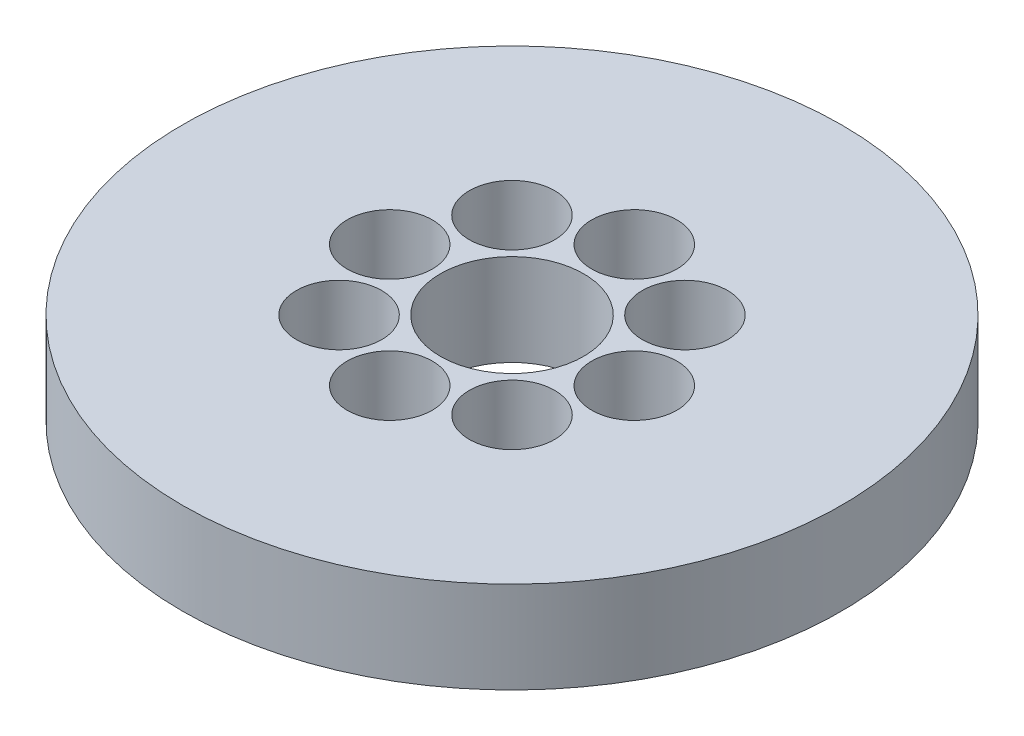
ISO-10303-21;
HEADER;
FILE_DESCRIPTION(('STEP AP214'),'2;1');
FILE_NAME('part.step','',(''),(''),'','','');
FILE_SCHEMA(('AUTOMOTIVE_DESIGN { 1 0 10303 214 1 1 1 1 }'));
ENDSEC;
DATA;
#1=APPLICATION_CONTEXT('core data for automotive mechanical design processes');
#2=APPLICATION_PROTOCOL_DEFINITION('international standard','automotive_design',2000,#1);
#3=PRODUCT_CONTEXT('',#1,'mechanical');
#4=PRODUCT('Part','Part','',(#3));
#5=PRODUCT_RELATED_PRODUCT_CATEGORY('part','',(#4));
#6=PRODUCT_DEFINITION_FORMATION('','',#4);
#7=PRODUCT_DEFINITION_CONTEXT('part definition',#1,'design');
#8=PRODUCT_DEFINITION('design','',#6,#7);
#9=PRODUCT_DEFINITION_SHAPE('','',#8);
#10=(LENGTH_UNIT() NAMED_UNIT(*) SI_UNIT(.MILLI.,.METRE.));
#11=(NAMED_UNIT(*) PLANE_ANGLE_UNIT() SI_UNIT($,.RADIAN.));
#12=(NAMED_UNIT(*) SI_UNIT($,.STERADIAN.) SOLID_ANGLE_UNIT());
#13=UNCERTAINTY_MEASURE_WITH_UNIT(LENGTH_MEASURE(1.E-05),#10,'distance_accuracy_value','');
#14=(GEOMETRIC_REPRESENTATION_CONTEXT(3) GLOBAL_UNCERTAINTY_ASSIGNED_CONTEXT((#13)) GLOBAL_UNIT_ASSIGNED_CONTEXT((#10,
#11,#12)) REPRESENTATION_CONTEXT('',''));
#15=CARTESIAN_POINT('',(0.,0.,0.));
#16=DIRECTION('',(0.,0.,1.));
#17=DIRECTION('',(1.,0.,0.));
#18=AXIS2_PLACEMENT_3D('',#15,#16,#17);
#19=CARTESIAN_POINT('',(0.,16.,0.));
#20=DIRECTION('',(0.,-1.,0.));
#21=DIRECTION('',(0.,0.,-1.));
#22=AXIS2_PLACEMENT_3D('',#19,#20,#21);
#23=CYLINDRICAL_SURFACE('',#22,57.5);
#24=CARTESIAN_POINT('',(0.,16.,0.));
#25=DIRECTION('',(0.,1.,0.));
#26=DIRECTION('',(0.,0.,1.));
#27=AXIS2_PLACEMENT_3D('',#24,#25,#26);
#28=CIRCLE('',#27,57.5);
#29=CARTESIAN_POINT('',(0.,16.,57.5));
#30=VERTEX_POINT('',#29);
#31=EDGE_CURVE('E10',#30,#30,#28,.T.);
#32=ORIENTED_EDGE('',*,*,#31,.F.);
#33=EDGE_LOOP('',(#32));
#34=FACE_BOUND('',#33,.T.);
#35=CARTESIAN_POINT('',(0.,0.,0.));
#36=DIRECTION('',(0.,1.,0.));
#37=DIRECTION('',(0.,0.,1.));
#38=AXIS2_PLACEMENT_3D('',#35,#36,#37);
#39=CIRCLE('',#38,57.5);
#40=CARTESIAN_POINT('',(0.,0.,57.5));
#41=VERTEX_POINT('',#40);
#42=EDGE_CURVE('E37',#41,#41,#39,.T.);
#43=ORIENTED_EDGE('',*,*,#42,.T.);
#44=EDGE_LOOP('',(#43));
#45=FACE_BOUND('',#44,.T.);
#46=ADVANCED_FACE('F40',(#34,#45),#23,.T.);
#47=CARTESIAN_POINT('',(0.,16.,0.));
#48=DIRECTION('',(0.,1.,0.));
#49=DIRECTION('',(0.,0.,1.));
#50=AXIS2_PLACEMENT_3D('',#47,#48,#49);
#51=PLANE('',#50);
#52=CARTESIAN_POINT('',(0.,16.,21.3365499022358));
#53=DIRECTION('',(0.,1.,0.));
#54=DIRECTION('',(1.,0.,0.));
#55=AXIS2_PLACEMENT_3D('',#52,#53,#54);
#56=CIRCLE('',#55,7.43929105474357);
#57=CARTESIAN_POINT('',(7.43929105474365,16.,21.3365499022358));
#58=VERTEX_POINT('',#57);
#59=EDGE_CURVE('E88',#58,#58,#56,.T.);
#60=ORIENTED_EDGE('',*,*,#59,.F.);
#61=EDGE_LOOP('',(#60));
#62=FACE_BOUND('',#61,.T.);
#63=CARTESIAN_POINT('',(15.0872191229962,16.,15.087219122996));
#64=DIRECTION('',(0.,1.,0.));
#65=DIRECTION('',(0.707106781186544,0.,-0.707106781186551));
#66=AXIS2_PLACEMENT_3D('',#63,#64,#65);
#67=CIRCLE('',#66,7.43929105474357);
#68=CARTESIAN_POINT('',(20.3475922750258,16.,9.82684597096639));
#69=VERTEX_POINT('',#68);
#70=EDGE_CURVE('E79',#69,#69,#67,.T.);
#71=ORIENTED_EDGE('',*,*,#70,.F.);
#72=EDGE_LOOP('',(#71));
#73=FACE_BOUND('',#72,.T.);
#74=CARTESIAN_POINT('',(21.3365499022358,16.,0.));
#75=DIRECTION('',(0.,1.,0.));
#76=DIRECTION('',(0.,0.,-1.));
#77=AXIS2_PLACEMENT_3D('',#74,#75,#76);
#78=CIRCLE('',#77,7.43929105474357);
#79=CARTESIAN_POINT('',(21.3365499022358,16.,-7.43929105474357));
#80=VERTEX_POINT('',#79);
#81=EDGE_CURVE('E74',#80,#80,#78,.T.);
#82=ORIENTED_EDGE('',*,*,#81,.F.);
#83=EDGE_LOOP('',(#82));
#84=FACE_BOUND('',#83,.T.);
#85=CARTESIAN_POINT('',(15.087219122996,16.,-15.0872191229962));
#86=DIRECTION('',(0.,1.,0.));
#87=DIRECTION('',(-0.707106781186554,0.,-0.707106781186541));
#88=AXIS2_PLACEMENT_3D('',#85,#86,#87);
#89=CIRCLE('',#88,7.43929105474357);
#90=CARTESIAN_POINT('',(9.82684597096632,16.,-20.3475922750258));
#91=VERTEX_POINT('',#90);
#92=EDGE_CURVE('E70',#91,#91,#89,.T.);
#93=ORIENTED_EDGE('',*,*,#92,.F.);
#94=EDGE_LOOP('',(#93));
#95=FACE_BOUND('',#94,.T.);
#96=CARTESIAN_POINT('',(-2.23488497456855E-13,16.,-21.3365499022358));
#97=DIRECTION('',(0.,1.,0.));
#98=DIRECTION('',(-1.,0.,0.));
#99=AXIS2_PLACEMENT_3D('',#96,#97,#98);
#100=CIRCLE('',#99,7.43929105474357);
#101=CARTESIAN_POINT('',(-7.43929105474379,16.,-21.3365499022357));
#102=VERTEX_POINT('',#101);
#103=EDGE_CURVE('E100',#102,#102,#100,.T.);
#104=ORIENTED_EDGE('',*,*,#103,.F.);
#105=EDGE_LOOP('',(#104));
#106=FACE_BOUND('',#105,.T.);
#107=CARTESIAN_POINT('',(-15.0872191229963,16.,-15.0872191229959));
#108=DIRECTION('',(0.,1.,0.));
#109=DIRECTION('',(-0.707106781186539,0.,0.707106781186556));
#110=AXIS2_PLACEMENT_3D('',#107,#108,#109);
#111=CIRCLE('',#110,7.43929105474357);
#112=CARTESIAN_POINT('',(-20.3475922750258,16.,-9.82684597096625));
#113=VERTEX_POINT('',#112);
#114=EDGE_CURVE('E93',#113,#113,#111,.T.);
#115=ORIENTED_EDGE('',*,*,#114,.F.);
#116=EDGE_LOOP('',(#115));
#117=FACE_BOUND('',#116,.T.);
#118=CARTESIAN_POINT('',(-15.0872191229961,16.,15.0872191229961));
#119=DIRECTION('',(0.,1.,0.));
#120=DIRECTION('',(0.707106781186549,0.,0.707106781186546));
#121=AXIS2_PLACEMENT_3D('',#118,#119,#120);
#122=CIRCLE('',#121,7.43929105474357);
#123=CARTESIAN_POINT('',(-9.82684597096647,16.,20.3475922750257));
#124=VERTEX_POINT('',#123);
#125=EDGE_CURVE('E61',#124,#124,#122,.T.);
#126=ORIENTED_EDGE('',*,*,#125,.F.);
#127=EDGE_LOOP('',(#126));
#128=FACE_BOUND('',#127,.T.);
#129=CARTESIAN_POINT('',(-21.3365499022358,16.,0.));
#130=DIRECTION('',(0.,1.,0.));
#131=DIRECTION('',(0.,0.,1.));
#132=AXIS2_PLACEMENT_3D('',#129,#130,#131);
#133=CIRCLE('',#132,7.43929105474357);
#134=CARTESIAN_POINT('',(-21.3365499022358,16.,7.43929105474357));
#135=VERTEX_POINT('',#134);
#136=EDGE_CURVE('E54',#135,#135,#133,.T.);
#137=ORIENTED_EDGE('',*,*,#136,.F.);
#138=EDGE_LOOP('',(#137));
#139=FACE_BOUND('',#138,.T.);
#140=CARTESIAN_POINT('',(0.,16.,0.));
#141=DIRECTION('',(0.,1.,0.));
#142=DIRECTION('',(0.,0.,1.));
#143=AXIS2_PLACEMENT_3D('',#140,#141,#142);
#144=CIRCLE('',#143,12.5);
#145=CARTESIAN_POINT('',(0.,16.,12.5));
#146=VERTEX_POINT('',#145);
#147=EDGE_CURVE('E50',#146,#146,#144,.T.);
#148=ORIENTED_EDGE('',*,*,#147,.F.);
#149=EDGE_LOOP('',(#148));
#150=FACE_BOUND('',#149,.T.);
#151=ORIENTED_EDGE('',*,*,#31,.T.);
#152=EDGE_LOOP('',(#151));
#153=FACE_BOUND('',#152,.T.);
#154=ADVANCED_FACE('F115',(#62,#73,#84,#95,#106,#117,#128,#139,#150,#153),#51,.T.);
#155=CARTESIAN_POINT('',(0.,0.,0.));
#156=DIRECTION('',(0.,1.,0.));
#157=DIRECTION('',(0.,0.,1.));
#158=AXIS2_PLACEMENT_3D('',#155,#156,#157);
#159=PLANE('',#158);
#160=CARTESIAN_POINT('',(0.,0.,0.));
#161=DIRECTION('',(0.,1.,0.));
#162=DIRECTION('',(0.,0.,1.));
#163=AXIS2_PLACEMENT_3D('',#160,#161,#162);
#164=CIRCLE('',#163,12.5);
#165=CARTESIAN_POINT('',(0.,0.,12.5));
#166=VERTEX_POINT('',#165);
#167=EDGE_CURVE('E47',#166,#166,#164,.T.);
#168=ORIENTED_EDGE('',*,*,#167,.T.);
#169=EDGE_LOOP('',(#168));
#170=FACE_BOUND('',#169,.T.);
#171=ORIENTED_EDGE('',*,*,#42,.F.);
#172=EDGE_LOOP('',(#171));
#173=FACE_BOUND('',#172,.T.);
#174=ADVANCED_FACE('F113',(#170,#173),#159,.F.);
#175=CARTESIAN_POINT('',(0.,16.,0.));
#176=DIRECTION('',(0.,-1.,0.));
#177=DIRECTION('',(0.,0.,-1.));
#178=AXIS2_PLACEMENT_3D('',#175,#176,#177);
#179=CYLINDRICAL_SURFACE('',#178,12.5);
#180=ORIENTED_EDGE('',*,*,#147,.T.);
#181=EDGE_LOOP('',(#180));
#182=FACE_BOUND('',#181,.T.);
#183=ORIENTED_EDGE('',*,*,#167,.F.);
#184=EDGE_LOOP('',(#183));
#185=FACE_BOUND('',#184,.T.);
#186=ADVANCED_FACE('F127',(#182,#185),#179,.F.);
#187=CARTESIAN_POINT('',(-21.3365499022358,3.56701706801266,0.));
#188=DIRECTION('',(0.,1.,0.));
#189=DIRECTION('',(0.,0.,1.));
#190=AXIS2_PLACEMENT_3D('',#187,#188,#189);
#191=CYLINDRICAL_SURFACE('',#190,7.43929105474357);
#192=CARTESIAN_POINT('',(-21.3365499022358,3.56701706801266,0.));
#193=DIRECTION('',(0.,1.,0.));
#194=DIRECTION('',(0.,0.,1.));
#195=AXIS2_PLACEMENT_3D('',#192,#193,#194);
#196=CIRCLE('',#195,7.43929105474357);
#197=CARTESIAN_POINT('',(-21.3365499022358,3.56701706801266,7.43929105474357));
#198=VERTEX_POINT('',#197);
#199=EDGE_CURVE('E55',#198,#198,#196,.T.);
#200=ORIENTED_EDGE('',*,*,#199,.F.);
#201=EDGE_LOOP('',(#200));
#202=FACE_BOUND('',#201,.T.);
#203=ORIENTED_EDGE('',*,*,#136,.T.);
#204=EDGE_LOOP('',(#203));
#205=FACE_BOUND('',#204,.T.);
#206=ADVANCED_FACE('F129',(#202,#205),#191,.F.);
#207=CARTESIAN_POINT('',(-21.3365499022358,3.56701706801266,0.));
#208=DIRECTION('',(0.,1.,0.));
#209=DIRECTION('',(0.,0.,1.));
#210=AXIS2_PLACEMENT_3D('',#207,#208,#209);
#211=PLANE('',#210);
#212=ORIENTED_EDGE('',*,*,#199,.T.);
#213=EDGE_LOOP('',(#212));
#214=FACE_BOUND('',#213,.T.);
#215=ADVANCED_FACE('F157',(#214),#211,.T.);
#216=CARTESIAN_POINT('',(-15.0872191229961,3.56701706801266,15.0872191229961));
#217=DIRECTION('',(0.,1.,0.));
#218=DIRECTION('',(0.,0.,1.));
#219=AXIS2_PLACEMENT_3D('',#216,#217,#218);
#220=CYLINDRICAL_SURFACE('',#219,7.43929105474357);
#221=CARTESIAN_POINT('',(-15.0872191229961,3.56701706801266,15.0872191229961));
#222=DIRECTION('',(0.,1.,0.));
#223=DIRECTION('',(0.707106781186549,0.,0.707106781186546));
#224=AXIS2_PLACEMENT_3D('',#221,#222,#223);
#225=CIRCLE('',#224,7.43929105474357);
#226=CARTESIAN_POINT('',(-9.82684597096647,3.56701706801266,20.3475922750257));
#227=VERTEX_POINT('',#226);
#228=EDGE_CURVE('E59',#227,#227,#225,.T.);
#229=ORIENTED_EDGE('',*,*,#228,.F.);
#230=EDGE_LOOP('',(#229));
#231=FACE_BOUND('',#230,.T.);
#232=ORIENTED_EDGE('',*,*,#125,.T.);
#233=EDGE_LOOP('',(#232));
#234=FACE_BOUND('',#233,.T.);
#235=ADVANCED_FACE('F170',(#231,#234),#220,.F.);
#236=CARTESIAN_POINT('',(-15.0872191229961,3.56701706801266,15.0872191229961));
#237=DIRECTION('',(0.,1.,0.));
#238=DIRECTION('',(0.707106781186549,0.,0.707106781186546));
#239=AXIS2_PLACEMENT_3D('',#236,#237,#238);
#240=PLANE('',#239);
#241=ORIENTED_EDGE('',*,*,#228,.T.);
#242=EDGE_LOOP('',(#241));
#243=FACE_BOUND('',#242,.T.);
#244=ADVANCED_FACE('F182',(#243),#240,.T.);
#245=CARTESIAN_POINT('',(-15.0872191229963,3.56701706801266,-15.0872191229959));
#246=DIRECTION('',(0.,1.,0.));
#247=DIRECTION('',(0.,0.,1.));
#248=AXIS2_PLACEMENT_3D('',#245,#246,#247);
#249=CYLINDRICAL_SURFACE('',#248,7.43929105474357);
#250=CARTESIAN_POINT('',(-15.0872191229963,3.56701706801266,-15.0872191229959));
#251=DIRECTION('',(0.,1.,0.));
#252=DIRECTION('',(-0.707106781186539,0.,0.707106781186556));
#253=AXIS2_PLACEMENT_3D('',#250,#251,#252);
#254=CIRCLE('',#253,7.43929105474357);
#255=CARTESIAN_POINT('',(-20.3475922750258,3.56701706801266,-9.82684597096625));
#256=VERTEX_POINT('',#255);
#257=EDGE_CURVE('E94',#256,#256,#254,.T.);
#258=ORIENTED_EDGE('',*,*,#257,.F.);
#259=EDGE_LOOP('',(#258));
#260=FACE_BOUND('',#259,.T.);
#261=ORIENTED_EDGE('',*,*,#114,.T.);
#262=EDGE_LOOP('',(#261));
#263=FACE_BOUND('',#262,.T.);
#264=ADVANCED_FACE('F189',(#260,#263),#249,.F.);
#265=CARTESIAN_POINT('',(-15.0872191229963,3.56701706801266,-15.0872191229959));
#266=DIRECTION('',(0.,1.,0.));
#267=DIRECTION('',(-0.707106781186539,0.,0.707106781186556));
#268=AXIS2_PLACEMENT_3D('',#265,#266,#267);
#269=PLANE('',#268);
#270=ORIENTED_EDGE('',*,*,#257,.T.);
#271=EDGE_LOOP('',(#270));
#272=FACE_BOUND('',#271,.T.);
#273=ADVANCED_FACE('F107',(#272),#269,.T.);
#274=CARTESIAN_POINT('',(-2.23488497456855E-13,3.56701706801266,-21.3365499022358));
#275=DIRECTION('',(0.,1.,0.));
#276=DIRECTION('',(0.,0.,1.));
#277=AXIS2_PLACEMENT_3D('',#274,#275,#276);
#278=CYLINDRICAL_SURFACE('',#277,7.43929105474357);
#279=CARTESIAN_POINT('',(-2.23488497456855E-13,3.56701706801266,-21.3365499022358));
#280=DIRECTION('',(0.,1.,0.));
#281=DIRECTION('',(-1.,0.,0.));
#282=AXIS2_PLACEMENT_3D('',#279,#280,#281);
#283=CIRCLE('',#282,7.43929105474357);
#284=CARTESIAN_POINT('',(-7.43929105474379,3.56701706801266,-21.3365499022357));
#285=VERTEX_POINT('',#284);
#286=EDGE_CURVE('E72',#285,#285,#283,.T.);
#287=ORIENTED_EDGE('',*,*,#286,.F.);
#288=EDGE_LOOP('',(#287));
#289=FACE_BOUND('',#288,.T.);
#290=ORIENTED_EDGE('',*,*,#103,.T.);
#291=EDGE_LOOP('',(#290));
#292=FACE_BOUND('',#291,.T.);
#293=ADVANCED_FACE('F104',(#289,#292),#278,.F.);
#294=CARTESIAN_POINT('',(-2.23488497456855E-13,3.56701706801266,-21.3365499022358));
#295=DIRECTION('',(0.,1.,0.));
#296=DIRECTION('',(-1.,0.,0.));
#297=AXIS2_PLACEMENT_3D('',#294,#295,#296);
#298=PLANE('',#297);
#299=ORIENTED_EDGE('',*,*,#286,.T.);
#300=EDGE_LOOP('',(#299));
#301=FACE_BOUND('',#300,.T.);
#302=ADVANCED_FACE('F103',(#301),#298,.T.);
#303=CARTESIAN_POINT('',(15.087219122996,3.56701706801266,-15.0872191229962));
#304=DIRECTION('',(0.,1.,0.));
#305=DIRECTION('',(0.,0.,1.));
#306=AXIS2_PLACEMENT_3D('',#303,#304,#305);
#307=CYLINDRICAL_SURFACE('',#306,7.43929105474357);
#308=CARTESIAN_POINT('',(15.087219122996,3.56701706801266,-15.0872191229962));
#309=DIRECTION('',(0.,1.,0.));
#310=DIRECTION('',(-0.707106781186554,0.,-0.707106781186541));
#311=AXIS2_PLACEMENT_3D('',#308,#309,#310);
#312=CIRCLE('',#311,7.43929105474357);
#313=CARTESIAN_POINT('',(9.82684597096632,3.56701706801266,-20.3475922750258));
#314=VERTEX_POINT('',#313);
#315=EDGE_CURVE('E69',#314,#314,#312,.T.);
#316=ORIENTED_EDGE('',*,*,#315,.F.);
#317=EDGE_LOOP('',(#316));
#318=FACE_BOUND('',#317,.T.);
#319=ORIENTED_EDGE('',*,*,#92,.T.);
#320=EDGE_LOOP('',(#319));
#321=FACE_BOUND('',#320,.T.);
#322=ADVANCED_FACE('F219',(#318,#321),#307,.F.);
#323=CARTESIAN_POINT('',(15.087219122996,3.56701706801266,-15.0872191229962));
#324=DIRECTION('',(0.,1.,0.));
#325=DIRECTION('',(-0.707106781186554,0.,-0.707106781186541));
#326=AXIS2_PLACEMENT_3D('',#323,#324,#325);
#327=PLANE('',#326);
#328=ORIENTED_EDGE('',*,*,#315,.T.);
#329=EDGE_LOOP('',(#328));
#330=FACE_BOUND('',#329,.T.);
#331=ADVANCED_FACE('F227',(#330),#327,.T.);
#332=CARTESIAN_POINT('',(21.3365499022358,3.56701706801266,0.));
#333=DIRECTION('',(0.,1.,0.));
#334=DIRECTION('',(0.,0.,1.));
#335=AXIS2_PLACEMENT_3D('',#332,#333,#334);
#336=CYLINDRICAL_SURFACE('',#335,7.43929105474357);
#337=CARTESIAN_POINT('',(21.3365499022358,3.56701706801266,0.));
#338=DIRECTION('',(0.,1.,0.));
#339=DIRECTION('',(0.,0.,-1.));
#340=AXIS2_PLACEMENT_3D('',#337,#338,#339);
#341=CIRCLE('',#340,7.43929105474357);
#342=CARTESIAN_POINT('',(21.3365499022358,3.56701706801266,-7.43929105474357));
#343=VERTEX_POINT('',#342);
#344=EDGE_CURVE('E80',#343,#343,#341,.T.);
#345=ORIENTED_EDGE('',*,*,#344,.F.);
#346=EDGE_LOOP('',(#345));
#347=FACE_BOUND('',#346,.T.);
#348=ORIENTED_EDGE('',*,*,#81,.T.);
#349=EDGE_LOOP('',(#348));
#350=FACE_BOUND('',#349,.T.);
#351=ADVANCED_FACE('F240',(#347,#350),#336,.F.);
#352=CARTESIAN_POINT('',(21.3365499022358,3.56701706801266,0.));
#353=DIRECTION('',(0.,1.,0.));
#354=DIRECTION('',(0.,0.,-1.));
#355=AXIS2_PLACEMENT_3D('',#352,#353,#354);
#356=PLANE('',#355);
#357=ORIENTED_EDGE('',*,*,#344,.T.);
#358=EDGE_LOOP('',(#357));
#359=FACE_BOUND('',#358,.T.);
#360=ADVANCED_FACE('F246',(#359),#356,.T.);
#361=CARTESIAN_POINT('',(15.0872191229962,3.56701706801266,15.087219122996));
#362=DIRECTION('',(0.,1.,0.));
#363=DIRECTION('',(0.,0.,1.));
#364=AXIS2_PLACEMENT_3D('',#361,#362,#363);
#365=CYLINDRICAL_SURFACE('',#364,7.43929105474357);
#366=CARTESIAN_POINT('',(15.0872191229962,3.56701706801266,15.087219122996));
#367=DIRECTION('',(0.,1.,0.));
#368=DIRECTION('',(0.707106781186544,0.,-0.707106781186551));
#369=AXIS2_PLACEMENT_3D('',#366,#367,#368);
#370=CIRCLE('',#369,7.43929105474357);
#371=CARTESIAN_POINT('',(20.3475922750258,3.56701706801266,9.82684597096639));
#372=VERTEX_POINT('',#371);
#373=EDGE_CURVE('E82',#372,#372,#370,.T.);
#374=ORIENTED_EDGE('',*,*,#373,.F.);
#375=EDGE_LOOP('',(#374));
#376=FACE_BOUND('',#375,.T.);
#377=ORIENTED_EDGE('',*,*,#70,.T.);
#378=EDGE_LOOP('',(#377));
#379=FACE_BOUND('',#378,.T.);
#380=ADVANCED_FACE('F254',(#376,#379),#365,.F.);
#381=CARTESIAN_POINT('',(15.0872191229962,3.56701706801266,15.087219122996));
#382=DIRECTION('',(0.,1.,0.));
#383=DIRECTION('',(0.707106781186544,0.,-0.707106781186551));
#384=AXIS2_PLACEMENT_3D('',#381,#382,#383);
#385=PLANE('',#384);
#386=ORIENTED_EDGE('',*,*,#373,.T.);
#387=EDGE_LOOP('',(#386));
#388=FACE_BOUND('',#387,.T.);
#389=ADVANCED_FACE('F262',(#388),#385,.T.);
#390=CARTESIAN_POINT('',(0.,3.56701706801266,21.3365499022358));
#391=DIRECTION('',(0.,1.,0.));
#392=DIRECTION('',(0.,0.,1.));
#393=AXIS2_PLACEMENT_3D('',#390,#391,#392);
#394=CYLINDRICAL_SURFACE('',#393,7.43929105474357);
#395=CARTESIAN_POINT('',(0.,3.56701706801266,21.3365499022358));
#396=DIRECTION('',(0.,1.,0.));
#397=DIRECTION('',(1.,0.,0.));
#398=AXIS2_PLACEMENT_3D('',#395,#396,#397);
#399=CIRCLE('',#398,7.43929105474357);
#400=CARTESIAN_POINT('',(7.43929105474365,3.56701706801266,21.3365499022358));
#401=VERTEX_POINT('',#400);
#402=EDGE_CURVE('E63',#401,#401,#399,.T.);
#403=ORIENTED_EDGE('',*,*,#402,.F.);
#404=EDGE_LOOP('',(#403));
#405=FACE_BOUND('',#404,.T.);
#406=ORIENTED_EDGE('',*,*,#59,.T.);
#407=EDGE_LOOP('',(#406));
#408=FACE_BOUND('',#407,.T.);
#409=ADVANCED_FACE('F272',(#405,#408),#394,.F.);
#410=CARTESIAN_POINT('',(0.,3.56701706801266,21.3365499022358));
#411=DIRECTION('',(0.,1.,0.));
#412=DIRECTION('',(1.,0.,0.));
#413=AXIS2_PLACEMENT_3D('',#410,#411,#412);
#414=PLANE('',#413);
#415=ORIENTED_EDGE('',*,*,#402,.T.);
#416=EDGE_LOOP('',(#415));
#417=FACE_BOUND('',#416,.T.);
#418=ADVANCED_FACE('F285',(#417),#414,.T.);
#419=CLOSED_SHELL('',(#46,#154,#174,#186,#206,#215,#235,#244,#264,#273,#293,#302,#322,#331,#351,
#360,#380,#389,#409,#418));
#420=MANIFOLD_SOLID_BREP('B2',#419);
#421=ADVANCED_BREP_SHAPE_REPRESENTATION('',(#18,#420),#14);
#422=SHAPE_DEFINITION_REPRESENTATION(#9,#421);
ENDSEC;
END-ISO-10303-21;
